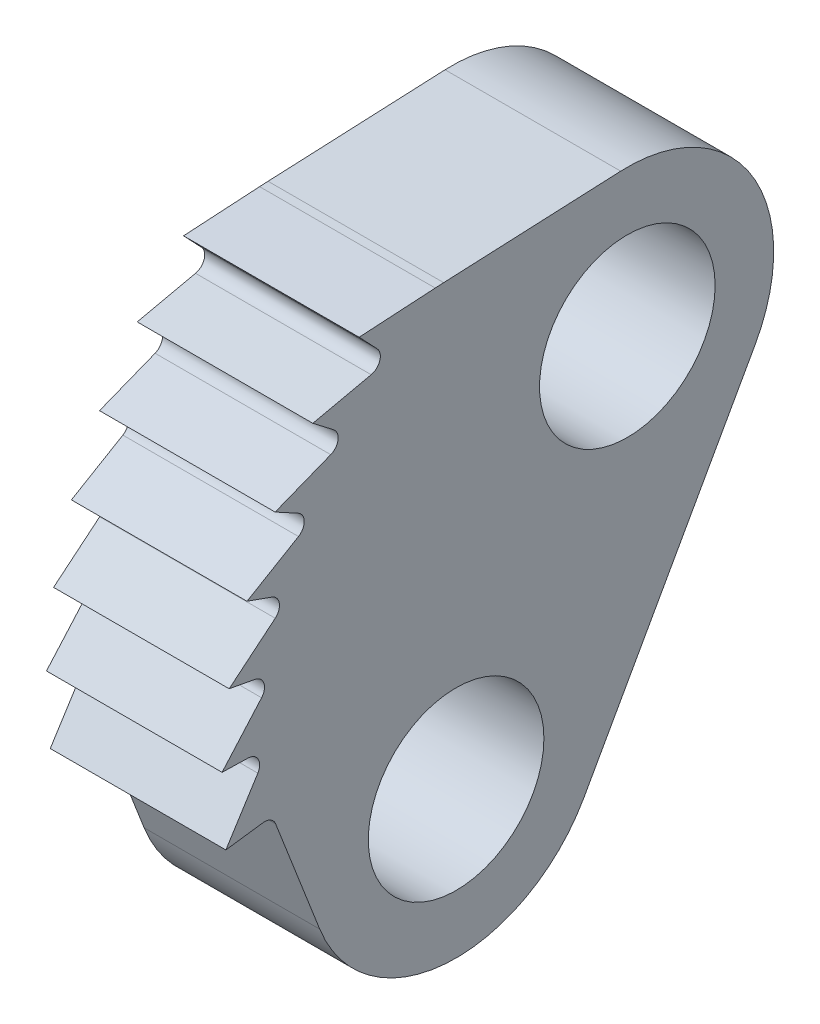
ISO-10303-21;
HEADER;
FILE_DESCRIPTION(('STEP AP214'),'2;1');
FILE_NAME('part.step','',(''),(''),'','','');
FILE_SCHEMA(('AUTOMOTIVE_DESIGN { 1 0 10303 214 1 1 1 1 }'));
ENDSEC;
DATA;
#1=APPLICATION_CONTEXT('core data for automotive mechanical design processes');
#2=APPLICATION_PROTOCOL_DEFINITION('international standard','automotive_design',2000,#1);
#3=PRODUCT_CONTEXT('',#1,'mechanical');
#4=PRODUCT('Part','Part','',(#3));
#5=PRODUCT_RELATED_PRODUCT_CATEGORY('part','',(#4));
#6=PRODUCT_DEFINITION_FORMATION('','',#4);
#7=PRODUCT_DEFINITION_CONTEXT('part definition',#1,'design');
#8=PRODUCT_DEFINITION('design','',#6,#7);
#9=PRODUCT_DEFINITION_SHAPE('','',#8);
#10=(LENGTH_UNIT() NAMED_UNIT(*) SI_UNIT(.MILLI.,.METRE.));
#11=(NAMED_UNIT(*) PLANE_ANGLE_UNIT() SI_UNIT($,.RADIAN.));
#12=(NAMED_UNIT(*) SI_UNIT($,.STERADIAN.) SOLID_ANGLE_UNIT());
#13=UNCERTAINTY_MEASURE_WITH_UNIT(LENGTH_MEASURE(1.E-05),#10,'distance_accuracy_value','');
#14=(GEOMETRIC_REPRESENTATION_CONTEXT(3) GLOBAL_UNCERTAINTY_ASSIGNED_CONTEXT((#13)) GLOBAL_UNIT_ASSIGNED_CONTEXT((#10,
#11,#12)) REPRESENTATION_CONTEXT('',''));
#15=CARTESIAN_POINT('',(0.,0.,0.));
#16=DIRECTION('',(0.,0.,1.));
#17=DIRECTION('',(1.,0.,0.));
#18=AXIS2_PLACEMENT_3D('',#15,#16,#17);
#19=CARTESIAN_POINT('',(3.,-43.5888383986154,-39.9249991557742));
#20=DIRECTION('',(1.,0.,0.));
#21=DIRECTION('',(0.,0.,-1.));
#22=AXIS2_PLACEMENT_3D('',#19,#20,#21);
#23=PLANE('',#22);
#24=CARTESIAN_POINT('',(3.,-43.5888383986154,-39.9249991557742));
#25=DIRECTION('',(1.,0.,0.));
#26=DIRECTION('',(0.,0.,-1.));
#27=AXIS2_PLACEMENT_3D('',#24,#25,#26);
#28=CIRCLE('',#27,1.5);
#29=CARTESIAN_POINT('',(3.,-43.5888383986154,-41.4249991557742));
#30=VERTEX_POINT('',#29);
#31=EDGE_CURVE('E268',#30,#30,#28,.T.);
#32=ORIENTED_EDGE('',*,*,#31,.F.);
#33=EDGE_LOOP('',(#32));
#34=FACE_BOUND('',#33,.T.);
#35=DIRECTION('',(0.,-0.0454217464710192,0.99896789985841));
#36=VECTOR('',#35,1.);
#37=CARTESIAN_POINT('',(3.,-41.2321933597373,-36.7153635488898));
#38=LINE('',#37,#36);
#39=CARTESIAN_POINT('',(3.,-41.0914186489693,-39.8114447895967));
#40=VERTEX_POINT('',#39);
#41=CARTESIAN_POINT('',(3.,-41.228909742996,-36.7875806689883));
#42=VERTEX_POINT('',#41);
#43=EDGE_CURVE('E245',#40,#42,#38,.T.);
#44=ORIENTED_EDGE('',*,*,#43,.T.);
#45=CARTESIAN_POINT('',(3.,-51.2185887415801,-37.2417981336985));
#46=DIRECTION('',(1.,0.,0.));
#47=DIRECTION('',(0.,0.,-1.));
#48=AXIS2_PLACEMENT_3D('',#45,#46,#47);
#49=CIRCLE('',#48,10.);
#50=CARTESIAN_POINT('',(3.,-41.236520718866,-36.6432014498543));
#51=VERTEX_POINT('',#50);
#52=EDGE_CURVE('E343',#42,#51,#49,.T.);
#53=ORIENTED_EDGE('',*,*,#52,.T.);
#54=DIRECTION('',(0.,-0.0598596683844226,0.998206802271407));
#55=VECTOR('',#54,1.);
#56=CARTESIAN_POINT('',(3.,-41.3144407469727,-35.3438240194671));
#57=LINE('',#56,#55);
#58=CARTESIAN_POINT('',(3.,-41.3144407469727,-35.3438240194671));
#59=VERTEX_POINT('',#58);
#60=EDGE_CURVE('E247',#51,#59,#57,.T.);
#61=ORIENTED_EDGE('',*,*,#60,.T.);
#62=DIRECTION('',(0.,-0.726193720806112,-0.687490130737726));
#63=VECTOR('',#62,1.);
#64=CARTESIAN_POINT('',(3.,-41.8953957236175,-35.8938161240573));
#65=LINE('',#64,#63);
#66=CARTESIAN_POINT('',(3.,-41.6388877953287,-35.6509791728389));
#67=VERTEX_POINT('',#66);
#68=EDGE_CURVE('E249',#59,#67,#65,.T.);
#69=ORIENTED_EDGE('',*,*,#68,.T.);
#70=CARTESIAN_POINT('',(3.,-41.7763858214763,-35.5057404286776));
#71=DIRECTION('',(1.,0.,0.));
#72=DIRECTION('',(0.,0.,-1.));
#73=AXIS2_PLACEMENT_3D('',#70,#71,#72);
#74=CIRCLE('',#73,0.2);
#75=CARTESIAN_POINT('',(3.,-41.9716675303531,-35.5489267017066));
#76=VERTEX_POINT('',#75);
#77=EDGE_CURVE('E379',#67,#76,#74,.F.);
#78=ORIENTED_EDGE('',*,*,#77,.T.);
#79=DIRECTION('',(0.,-0.215931365144987,0.976408544384277));
#80=VECTOR('',#79,1.);
#81=CARTESIAN_POINT('',(3.,-42.1920861511569,-34.5522274748498));
#82=LINE('',#81,#80);
#83=CARTESIAN_POINT('',(3.,-42.1920861511569,-34.5522274748498));
#84=VERTEX_POINT('',#83);
#85=EDGE_CURVE('E252',#76,#84,#82,.T.);
#86=ORIENTED_EDGE('',*,*,#85,.T.);
#87=DIRECTION('',(0.,-0.609174333581545,-0.793036336686713));
#88=VECTOR('',#87,1.);
#89=CARTESIAN_POINT('',(3.,-42.6794256180221,-35.1866565441991));
#90=LINE('',#89,#88);
#91=CARTESIAN_POINT('',(3.,-42.4642515648779,-34.9065383030837));
#92=VERTEX_POINT('',#91);
#93=EDGE_CURVE('E254',#84,#92,#90,.T.);
#94=ORIENTED_EDGE('',*,*,#93,.T.);
#95=CARTESIAN_POINT('',(3.,-42.6228588322152,-34.7847034363674));
#96=DIRECTION('',(1.,0.,0.));
#97=DIRECTION('',(0.,0.,-1.));
#98=AXIS2_PLACEMENT_3D('',#95,#96,#97);
#99=CIRCLE('',#98,0.2);
#100=CARTESIAN_POINT('',(3.,-42.8089313536639,-34.8580315807712));
#101=VERTEX_POINT('',#100);
#102=EDGE_CURVE('E383',#92,#101,#99,.F.);
#103=ORIENTED_EDGE('',*,*,#102,.T.);
#104=DIRECTION('',(0.,-0.36664072201932,0.930362607243623));
#105=VECTOR('',#104,1.);
#106=CARTESIAN_POINT('',(3.,-43.1831912126877,-33.9083351686808));
#107=LINE('',#106,#105);
#108=CARTESIAN_POINT('',(3.,-43.1831912126877,-33.9083351686808));
#109=VERTEX_POINT('',#108);
#110=EDGE_CURVE('E257',#101,#109,#107,.T.);
#111=ORIENTED_EDGE('',*,*,#110,.T.);
#112=DIRECTION('',(0.,-0.4770269920441,-0.878888644175904));
#113=VECTOR('',#112,1.);
#114=CARTESIAN_POINT('',(3.,-43.564812806323,-34.6114460840214));
#115=LINE('',#114,#113);
#116=CARTESIAN_POINT('',(3.,-43.3963161614728,-34.3010028801558));
#117=VERTEX_POINT('',#116);
#118=EDGE_CURVE('E259',#109,#117,#115,.T.);
#119=ORIENTED_EDGE('',*,*,#118,.T.);
#120=CARTESIAN_POINT('',(3.,-43.5720938903081,-34.205597481747));
#121=DIRECTION('',(1.,0.,0.));
#122=DIRECTION('',(0.,0.,-1.));
#123=AXIS2_PLACEMENT_3D('',#120,#121,#122);
#124=CIRCLE('',#123,0.2);
#125=CARTESIAN_POINT('',(3.,-43.7443363851892,-34.307246500223));
#126=VERTEX_POINT('',#125);
#127=EDGE_CURVE('E387',#117,#126,#124,.F.);
#128=ORIENTED_EDGE('',*,*,#127,.T.);
#129=DIRECTION('',(0.,-0.508245092379624,0.861212474405723));
#130=VECTOR('',#129,1.);
#131=CARTESIAN_POINT('',(3.,-44.2631432857863,-33.4281372253846));
#132=LINE('',#131,#130);
#133=CARTESIAN_POINT('',(3.,-44.2631432857863,-33.4281372253846));
#134=VERTEX_POINT('',#133);
#135=EDGE_CURVE('E262',#126,#134,#132,.T.);
#136=ORIENTED_EDGE('',*,*,#135,.T.);
#137=DIRECTION('',(0.,-0.333033382297625,-0.942915036615391));
#138=VECTOR('',#137,1.);
#139=CARTESIAN_POINT('',(3.,-44.5295699916245,-34.1824692546769));
#140=LINE('',#139,#138);
#141=CARTESIAN_POINT('',(3.,-44.4119351229983,-33.8494104913402));
#142=VERTEX_POINT('',#141);
#143=EDGE_CURVE('E209',#134,#142,#140,.T.);
#144=ORIENTED_EDGE('',*,*,#143,.T.);
#145=CARTESIAN_POINT('',(3.,-44.6005181303213,-33.7828038148807));
#146=DIRECTION('',(1.,0.,0.));
#147=DIRECTION('',(0.,0.,-1.));
#148=AXIS2_PLACEMENT_3D('',#145,#146,#147);
#149=CIRCLE('',#148,0.2);
#150=CARTESIAN_POINT('',(3.,-44.7546532079938,-33.910249402607));
#151=VERTEX_POINT('',#150);
#152=EDGE_CURVE('E205',#142,#151,#149,.F.);
#153=ORIENTED_EDGE('',*,*,#152,.T.);
#154=DIRECTION('',(0.,-0.637227938631925,0.770675388361992));
#155=VECTOR('',#154,1.);
#156=CARTESIAN_POINT('',(3.,-45.4051233389844,-33.1235586591105));
#157=LINE('',#156,#155);
#158=CARTESIAN_POINT('',(3.,-45.4051233389844,-33.1235586591105));
#159=VERTEX_POINT('',#158);
#160=EDGE_CURVE('E196',#151,#159,#157,.T.);
#161=ORIENTED_EDGE('',*,*,#160,.T.);
#162=DIRECTION('',(0.,-0.180769375204551,-0.983525512118601));
#163=VECTOR('',#162,1.);
#164=CARTESIAN_POINT('',(3.,-45.549738839148,-33.9103790688054));
#165=LINE('',#164,#163);
#166=CARTESIAN_POINT('',(3.,-45.4858870367938,-33.5629757736451));
#167=VERTEX_POINT('',#166);
#168=EDGE_CURVE('E201',#159,#167,#165,.T.);
#169=ORIENTED_EDGE('',*,*,#168,.T.);
#170=CARTESIAN_POINT('',(3.,-45.6825921392175,-33.5268218986042));
#171=DIRECTION('',(1.,0.,0.));
#172=DIRECTION('',(0.,0.,-1.));
#173=AXIS2_PLACEMENT_3D('',#170,#171,#172);
#174=CIRCLE('',#173,0.2);
#175=CARTESIAN_POINT('',(3.,-45.8147920802838,-33.6768991306618));
#176=VERTEX_POINT('',#175);
#177=EDGE_CURVE('E398',#167,#176,#174,.F.);
#178=ORIENTED_EDGE('',*,*,#177,.T.);
#179=DIRECTION('',(0.,-0.750386160288116,0.660999705331294));
#180=VECTOR('',#179,1.);
#181=CARTESIAN_POINT('',(3.,-46.5807719665771,-33.0021632334337));
#182=LINE('',#181,#180);
#183=CARTESIAN_POINT('',(3.,-46.5807719665771,-33.0021632334337));
#184=VERTEX_POINT('',#183);
#185=EDGE_CURVE('E225',#176,#184,#182,.T.);
#186=ORIENTED_EDGE('',*,*,#185,.T.);
#187=DIRECTION('',(0.,-0.0240162248588486,-0.999711568875508));
#188=VECTOR('',#187,1.);
#189=CARTESIAN_POINT('',(3.,-46.5999849464642,-33.8019324885341));
#190=LINE('',#189,#188);
#191=CARTESIAN_POINT('',(3.,-46.5915018765789,-33.4488119146823));
#192=VERTEX_POINT('',#191);
#193=EDGE_CURVE('E227',#184,#192,#190,.T.);
#194=ORIENTED_EDGE('',*,*,#193,.T.);
#195=CARTESIAN_POINT('',(3.,-46.791444190354,-33.4440086697105));
#196=DIRECTION('',(1.,0.,0.));
#197=DIRECTION('',(0.,0.,-1.));
#198=AXIS2_PLACEMENT_3D('',#195,#196,#197);
#199=CIRCLE('',#198,0.2);
#200=CARTESIAN_POINT('',(3.,-46.8984260024778,-33.6129905973676));
#201=VERTEX_POINT('',#200);
#202=EDGE_CURVE('E11',#192,#201,#199,.F.);
#203=ORIENTED_EDGE('',*,*,#202,.T.);
#204=DIRECTION('',(0.,-0.8449096382854,0.534909060619124));
#205=VECTOR('',#204,1.);
#206=CARTESIAN_POINT('',(3.,-47.7608936530185,-33.0669656263407));
#207=LINE('',#206,#205);
#208=CARTESIAN_POINT('',(3.,-47.7608936530185,-33.0669656263407));
#209=VERTEX_POINT('',#208);
#210=EDGE_CURVE('E232',#201,#209,#207,.T.);
#211=ORIENTED_EDGE('',*,*,#210,.T.);
#212=DIRECTION('',(0.,0.133333333333322,-0.991071249821235));
#213=VECTOR('',#212,1.);
#214=CARTESIAN_POINT('',(3.,-47.6542269863519,-33.8598226261978));
#215=LINE('',#214,#213);
#216=CARTESIAN_POINT('',(3.,-47.6752026310834,-33.7039099378987));
#217=VERTEX_POINT('',#216);
#218=EDGE_CURVE('E234',#209,#217,#215,.T.);
#219=ORIENTED_EDGE('',*,*,#218,.T.);
#220=CARTESIAN_POINT('',(3.,-47.8734168810476,-33.7305766045654));
#221=DIRECTION('',(1.,0.,0.));
#222=DIRECTION('',(0.,0.,-1.));
#223=AXIS2_PLACEMENT_3D('',#220,#221,#222);
#224=CIRCLE('',#223,0.2);
#225=CARTESIAN_POINT('',(3.,-47.8008121084282,-33.9169325730581));
#226=VERTEX_POINT('',#225);
#227=EDGE_CURVE('E391',#217,#226,#224,.F.);
#228=ORIENTED_EDGE('',*,*,#227,.T.);
#229=DIRECTION('',(0.,-0.931779842463879,-0.363023863097166));
#230=VECTOR('',#229,1.);
#231=CARTESIAN_POINT('',(3.,-47.6542269863519,-33.8598226261978));
#232=LINE('',#231,#230);
#233=CARTESIAN_POINT('',(3.,-49.7351364482538,-34.6705503938403));
#234=VERTEX_POINT('',#233);
#235=EDGE_CURVE('E237',#226,#234,#232,.T.);
#236=ORIENTED_EDGE('',*,*,#235,.T.);
#237=CARTESIAN_POINT('',(3.,-48.8275767905109,-37.));
#238=DIRECTION('',(1.,0.,0.));
#239=DIRECTION('',(0.,0.,-1.));
#240=AXIS2_PLACEMENT_3D('',#237,#238,#239);
#241=CIRCLE('',#240,2.5);
#242=CARTESIAN_POINT('',(3.,-50.0463264387501,-39.1828076632898));
#243=VERTEX_POINT('',#242);
#244=EDGE_CURVE('E239',#234,#243,#241,.T.);
#245=ORIENTED_EDGE('',*,*,#244,.T.);
#246=DIRECTION('',(0.,0.873123065315921,-0.487499859295703));
#247=VECTOR('',#246,1.);
#248=CARTESIAN_POINT('',(3.,-50.0463264387501,-39.1828076632898));
#249=LINE('',#248,#247);
#250=CARTESIAN_POINT('',(3.,-44.8075880468546,-42.1078068190641));
#251=VERTEX_POINT('',#250);
#252=EDGE_CURVE('E241',#243,#251,#249,.T.);
#253=ORIENTED_EDGE('',*,*,#252,.T.);
#254=CARTESIAN_POINT('',(3.,-43.5888383986154,-39.9249991557742));
#255=DIRECTION('',(1.,0.,0.));
#256=DIRECTION('',(0.,0.,-1.));
#257=AXIS2_PLACEMENT_3D('',#254,#255,#256);
#258=CIRCLE('',#257,2.5);
#259=EDGE_CURVE('E243',#251,#40,#258,.T.);
#260=ORIENTED_EDGE('',*,*,#259,.T.);
#261=EDGE_LOOP('',(#44,#53,#61,#69,#78,#86,#94,#103,#111,#119,#128,#136,#144,#153,#161,#169,
#178,#186,#194,#203,#211,#219,#228,#236,#245,#253,#260));
#262=FACE_BOUND('',#261,.T.);
#263=CARTESIAN_POINT('',(3.,-48.8275767905109,-37.));
#264=DIRECTION('',(1.,0.,0.));
#265=DIRECTION('',(0.,0.,-1.));
#266=AXIS2_PLACEMENT_3D('',#263,#264,#265);
#267=CIRCLE('',#266,1.5);
#268=CARTESIAN_POINT('',(3.,-48.8275767905109,-38.5));
#269=VERTEX_POINT('',#268);
#270=EDGE_CURVE('E511',#269,#269,#267,.T.);
#271=ORIENTED_EDGE('',*,*,#270,.F.);
#272=EDGE_LOOP('',(#271));
#273=FACE_BOUND('',#272,.T.);
#274=ADVANCED_FACE('F17',(#34,#262,#273),#23,.T.);
#275=CARTESIAN_POINT('',(0.,-43.5888383986154,-39.9249991557742));
#276=DIRECTION('',(1.,0.,0.));
#277=DIRECTION('',(0.,0.,-1.));
#278=AXIS2_PLACEMENT_3D('',#275,#276,#277);
#279=PLANE('',#278);
#280=DIRECTION('',(0.,-0.0598596683844226,0.998206802271407));
#281=VECTOR('',#280,1.);
#282=CARTESIAN_POINT('',(0.,-41.3144407469727,-35.3438240194671));
#283=LINE('',#282,#281);
#284=CARTESIAN_POINT('',(0.,-41.236520718866,-36.6432014498543));
#285=VERTEX_POINT('',#284);
#286=CARTESIAN_POINT('',(0.,-41.3144407469727,-35.3438240194671));
#287=VERTEX_POINT('',#286);
#288=EDGE_CURVE('E292',#285,#287,#283,.T.);
#289=ORIENTED_EDGE('',*,*,#288,.F.);
#290=CARTESIAN_POINT('',(0.,-51.2185887415801,-37.2417981336985));
#291=DIRECTION('',(1.,0.,0.));
#292=DIRECTION('',(0.,0.,-1.));
#293=AXIS2_PLACEMENT_3D('',#290,#291,#292);
#294=CIRCLE('',#293,10.);
#295=CARTESIAN_POINT('',(0.,-41.228909742996,-36.7875806689883));
#296=VERTEX_POINT('',#295);
#297=EDGE_CURVE('E339',#285,#296,#294,.F.);
#298=ORIENTED_EDGE('',*,*,#297,.T.);
#299=DIRECTION('',(0.,-0.0454217464710192,0.99896789985841));
#300=VECTOR('',#299,1.);
#301=CARTESIAN_POINT('',(0.,-41.2321933597373,-36.7153635488898));
#302=LINE('',#301,#300);
#303=CARTESIAN_POINT('',(0.,-41.0914186489693,-39.8114447895967));
#304=VERTEX_POINT('',#303);
#305=EDGE_CURVE('E289',#304,#296,#302,.T.);
#306=ORIENTED_EDGE('',*,*,#305,.F.);
#307=CARTESIAN_POINT('',(0.,-43.5888383986154,-39.9249991557742));
#308=DIRECTION('',(1.,0.,0.));
#309=DIRECTION('',(0.,0.,-1.));
#310=AXIS2_PLACEMENT_3D('',#307,#308,#309);
#311=CIRCLE('',#310,2.5);
#312=CARTESIAN_POINT('',(0.,-44.8075880468546,-42.1078068190641));
#313=VERTEX_POINT('',#312);
#314=EDGE_CURVE('E287',#313,#304,#311,.T.);
#315=ORIENTED_EDGE('',*,*,#314,.F.);
#316=DIRECTION('',(0.,0.873123065315921,-0.487499859295703));
#317=VECTOR('',#316,1.);
#318=CARTESIAN_POINT('',(0.,-50.0463264387501,-39.1828076632898));
#319=LINE('',#318,#317);
#320=CARTESIAN_POINT('',(0.,-50.0463264387501,-39.1828076632898));
#321=VERTEX_POINT('',#320);
#322=EDGE_CURVE('E285',#321,#313,#319,.T.);
#323=ORIENTED_EDGE('',*,*,#322,.F.);
#324=CARTESIAN_POINT('',(0.,-48.8275767905109,-37.));
#325=DIRECTION('',(1.,0.,0.));
#326=DIRECTION('',(0.,0.,-1.));
#327=AXIS2_PLACEMENT_3D('',#324,#325,#326);
#328=CIRCLE('',#327,2.5);
#329=CARTESIAN_POINT('',(0.,-49.7351364482538,-34.6705503938403));
#330=VERTEX_POINT('',#329);
#331=EDGE_CURVE('E283',#330,#321,#328,.T.);
#332=ORIENTED_EDGE('',*,*,#331,.F.);
#333=DIRECTION('',(0.,-0.931779842463879,-0.363023863097166));
#334=VECTOR('',#333,1.);
#335=CARTESIAN_POINT('',(0.,-47.6542269863519,-33.8598226261978));
#336=LINE('',#335,#334);
#337=CARTESIAN_POINT('',(0.,-47.8008121084282,-33.9169325730581));
#338=VERTEX_POINT('',#337);
#339=EDGE_CURVE('E281',#338,#330,#336,.T.);
#340=ORIENTED_EDGE('',*,*,#339,.F.);
#341=CARTESIAN_POINT('',(0.,-47.8734168810476,-33.7305766045654));
#342=DIRECTION('',(1.,0.,0.));
#343=DIRECTION('',(0.,0.,-1.));
#344=AXIS2_PLACEMENT_3D('',#341,#342,#343);
#345=CIRCLE('',#344,0.2);
#346=CARTESIAN_POINT('',(0.,-47.6752026310834,-33.7039099378987));
#347=VERTEX_POINT('',#346);
#348=EDGE_CURVE('E389',#338,#347,#345,.T.);
#349=ORIENTED_EDGE('',*,*,#348,.T.);
#350=DIRECTION('',(0.,0.133333333333322,-0.991071249821235));
#351=VECTOR('',#350,1.);
#352=CARTESIAN_POINT('',(0.,-47.6542269863519,-33.8598226261978));
#353=LINE('',#352,#351);
#354=CARTESIAN_POINT('',(0.,-47.7608936530185,-33.0669656263407));
#355=VERTEX_POINT('',#354);
#356=EDGE_CURVE('E278',#355,#347,#353,.T.);
#357=ORIENTED_EDGE('',*,*,#356,.F.);
#358=DIRECTION('',(0.,-0.8449096382854,0.534909060619124));
#359=VECTOR('',#358,1.);
#360=CARTESIAN_POINT('',(0.,-47.7608936530185,-33.0669656263407));
#361=LINE('',#360,#359);
#362=CARTESIAN_POINT('',(0.,-46.8984260024778,-33.6129905973676));
#363=VERTEX_POINT('',#362);
#364=EDGE_CURVE('E276',#363,#355,#361,.T.);
#365=ORIENTED_EDGE('',*,*,#364,.F.);
#366=CARTESIAN_POINT('',(0.,-46.791444190354,-33.4440086697105));
#367=DIRECTION('',(1.,0.,0.));
#368=DIRECTION('',(0.,0.,-1.));
#369=AXIS2_PLACEMENT_3D('',#366,#367,#368);
#370=CIRCLE('',#369,0.2);
#371=CARTESIAN_POINT('',(0.,-46.5915018765789,-33.4488119146823));
#372=VERTEX_POINT('',#371);
#373=EDGE_CURVE('E25',#363,#372,#370,.T.);
#374=ORIENTED_EDGE('',*,*,#373,.T.);
#375=DIRECTION('',(0.,-0.0240162248588486,-0.999711568875508));
#376=VECTOR('',#375,1.);
#377=CARTESIAN_POINT('',(0.,-46.5999849464642,-33.8019324885341));
#378=LINE('',#377,#376);
#379=CARTESIAN_POINT('',(0.,-46.5807719665771,-33.0021632334337));
#380=VERTEX_POINT('',#379);
#381=EDGE_CURVE('E274',#380,#372,#378,.T.);
#382=ORIENTED_EDGE('',*,*,#381,.F.);
#383=DIRECTION('',(0.,-0.750386160288116,0.660999705331294));
#384=VECTOR('',#383,1.);
#385=CARTESIAN_POINT('',(0.,-46.5807719665771,-33.0021632334337));
#386=LINE('',#385,#384);
#387=CARTESIAN_POINT('',(0.,-45.8147920802838,-33.6768991306618));
#388=VERTEX_POINT('',#387);
#389=EDGE_CURVE('E272',#388,#380,#386,.T.);
#390=ORIENTED_EDGE('',*,*,#389,.F.);
#391=CARTESIAN_POINT('',(0.,-45.6825921392175,-33.5268218986042));
#392=DIRECTION('',(1.,0.,0.));
#393=DIRECTION('',(0.,0.,-1.));
#394=AXIS2_PLACEMENT_3D('',#391,#392,#393);
#395=CIRCLE('',#394,0.2);
#396=CARTESIAN_POINT('',(0.,-45.4858870367938,-33.5629757736451));
#397=VERTEX_POINT('',#396);
#398=EDGE_CURVE('E396',#388,#397,#395,.T.);
#399=ORIENTED_EDGE('',*,*,#398,.T.);
#400=DIRECTION('',(0.,-0.180769375204551,-0.983525512118601));
#401=VECTOR('',#400,1.);
#402=CARTESIAN_POINT('',(0.,-45.549738839148,-33.9103790688054));
#403=LINE('',#402,#401);
#404=CARTESIAN_POINT('',(0.,-45.4051233389844,-33.1235586591105));
#405=VERTEX_POINT('',#404);
#406=EDGE_CURVE('E270',#405,#397,#403,.T.);
#407=ORIENTED_EDGE('',*,*,#406,.F.);
#408=DIRECTION('',(0.,-0.637227938631925,0.770675388361992));
#409=VECTOR('',#408,1.);
#410=CARTESIAN_POINT('',(0.,-45.4051233389844,-33.1235586591105));
#411=LINE('',#410,#409);
#412=CARTESIAN_POINT('',(0.,-44.7546532079938,-33.910249402607));
#413=VERTEX_POINT('',#412);
#414=EDGE_CURVE('E215',#413,#405,#411,.T.);
#415=ORIENTED_EDGE('',*,*,#414,.F.);
#416=CARTESIAN_POINT('',(0.,-44.6005181303213,-33.7828038148807));
#417=DIRECTION('',(1.,0.,0.));
#418=DIRECTION('',(0.,0.,-1.));
#419=AXIS2_PLACEMENT_3D('',#416,#417,#418);
#420=CIRCLE('',#419,0.2);
#421=CARTESIAN_POINT('',(0.,-44.4119351229983,-33.8494104913402));
#422=VERTEX_POINT('',#421);
#423=EDGE_CURVE('E393',#413,#422,#420,.T.);
#424=ORIENTED_EDGE('',*,*,#423,.T.);
#425=DIRECTION('',(0.,-0.333033382297625,-0.942915036615391));
#426=VECTOR('',#425,1.);
#427=CARTESIAN_POINT('',(0.,-44.5295699916245,-34.1824692546769));
#428=LINE('',#427,#426);
#429=CARTESIAN_POINT('',(0.,-44.2631432857863,-33.4281372253846));
#430=VERTEX_POINT('',#429);
#431=EDGE_CURVE('E265',#430,#422,#428,.T.);
#432=ORIENTED_EDGE('',*,*,#431,.F.);
#433=DIRECTION('',(0.,-0.508245092379624,0.861212474405723));
#434=VECTOR('',#433,1.);
#435=CARTESIAN_POINT('',(0.,-44.2631432857863,-33.4281372253846));
#436=LINE('',#435,#434);
#437=CARTESIAN_POINT('',(0.,-43.7443363851892,-34.307246500223));
#438=VERTEX_POINT('',#437);
#439=EDGE_CURVE('E307',#438,#430,#436,.T.);
#440=ORIENTED_EDGE('',*,*,#439,.F.);
#441=CARTESIAN_POINT('',(0.,-43.5720938903081,-34.205597481747));
#442=DIRECTION('',(1.,0.,0.));
#443=DIRECTION('',(0.,0.,-1.));
#444=AXIS2_PLACEMENT_3D('',#441,#442,#443);
#445=CIRCLE('',#444,0.2);
#446=CARTESIAN_POINT('',(0.,-43.3963161614728,-34.3010028801558));
#447=VERTEX_POINT('',#446);
#448=EDGE_CURVE('E385',#438,#447,#445,.T.);
#449=ORIENTED_EDGE('',*,*,#448,.T.);
#450=DIRECTION('',(0.,-0.4770269920441,-0.878888644175904));
#451=VECTOR('',#450,1.);
#452=CARTESIAN_POINT('',(0.,-43.564812806323,-34.6114460840214));
#453=LINE('',#452,#451);
#454=CARTESIAN_POINT('',(0.,-43.1831912126877,-33.9083351686808));
#455=VERTEX_POINT('',#454);
#456=EDGE_CURVE('E304',#455,#447,#453,.T.);
#457=ORIENTED_EDGE('',*,*,#456,.F.);
#458=DIRECTION('',(0.,-0.36664072201932,0.930362607243623));
#459=VECTOR('',#458,1.);
#460=CARTESIAN_POINT('',(0.,-43.1831912126877,-33.9083351686808));
#461=LINE('',#460,#459);
#462=CARTESIAN_POINT('',(0.,-42.8089313536639,-34.8580315807712));
#463=VERTEX_POINT('',#462);
#464=EDGE_CURVE('E302',#463,#455,#461,.T.);
#465=ORIENTED_EDGE('',*,*,#464,.F.);
#466=CARTESIAN_POINT('',(0.,-42.6228588322152,-34.7847034363674));
#467=DIRECTION('',(1.,0.,0.));
#468=DIRECTION('',(0.,0.,-1.));
#469=AXIS2_PLACEMENT_3D('',#466,#467,#468);
#470=CIRCLE('',#469,0.2);
#471=CARTESIAN_POINT('',(0.,-42.4642515648779,-34.9065383030837));
#472=VERTEX_POINT('',#471);
#473=EDGE_CURVE('E381',#463,#472,#470,.T.);
#474=ORIENTED_EDGE('',*,*,#473,.T.);
#475=DIRECTION('',(0.,-0.609174333581545,-0.793036336686713));
#476=VECTOR('',#475,1.);
#477=CARTESIAN_POINT('',(0.,-42.6794256180221,-35.1866565441991));
#478=LINE('',#477,#476);
#479=CARTESIAN_POINT('',(0.,-42.1920861511569,-34.5522274748498));
#480=VERTEX_POINT('',#479);
#481=EDGE_CURVE('E299',#480,#472,#478,.T.);
#482=ORIENTED_EDGE('',*,*,#481,.F.);
#483=DIRECTION('',(0.,-0.215931365144987,0.976408544384277));
#484=VECTOR('',#483,1.);
#485=CARTESIAN_POINT('',(0.,-42.1920861511569,-34.5522274748498));
#486=LINE('',#485,#484);
#487=CARTESIAN_POINT('',(0.,-41.9716675303531,-35.5489267017066));
#488=VERTEX_POINT('',#487);
#489=EDGE_CURVE('E297',#488,#480,#486,.T.);
#490=ORIENTED_EDGE('',*,*,#489,.F.);
#491=CARTESIAN_POINT('',(0.,-41.7763858214763,-35.5057404286776));
#492=DIRECTION('',(1.,0.,0.));
#493=DIRECTION('',(0.,0.,-1.));
#494=AXIS2_PLACEMENT_3D('',#491,#492,#493);
#495=CIRCLE('',#494,0.2);
#496=CARTESIAN_POINT('',(0.,-41.6388877953287,-35.6509791728389));
#497=VERTEX_POINT('',#496);
#498=EDGE_CURVE('E377',#488,#497,#495,.T.);
#499=ORIENTED_EDGE('',*,*,#498,.T.);
#500=DIRECTION('',(0.,-0.726193720806112,-0.687490130737726));
#501=VECTOR('',#500,1.);
#502=CARTESIAN_POINT('',(0.,-41.8953957236175,-35.8938161240573));
#503=LINE('',#502,#501);
#504=EDGE_CURVE('E294',#287,#497,#503,.T.);
#505=ORIENTED_EDGE('',*,*,#504,.F.);
#506=EDGE_LOOP('',(#289,#298,#306,#315,#323,#332,#340,#349,#357,#365,#374,#382,#390,#399,#407,
#415,#424,#432,#440,#449,#457,#465,#474,#482,#490,#499,#505));
#507=FACE_BOUND('',#506,.T.);
#508=CARTESIAN_POINT('',(0.,-43.5888383986154,-39.9249991557742));
#509=DIRECTION('',(1.,0.,0.));
#510=DIRECTION('',(0.,0.,-1.));
#511=AXIS2_PLACEMENT_3D('',#508,#509,#510);
#512=CIRCLE('',#511,1.5);
#513=CARTESIAN_POINT('',(0.,-43.5888383986154,-41.4249991557742));
#514=VERTEX_POINT('',#513);
#515=EDGE_CURVE('E508',#514,#514,#512,.T.);
#516=ORIENTED_EDGE('',*,*,#515,.T.);
#517=EDGE_LOOP('',(#516));
#518=FACE_BOUND('',#517,.T.);
#519=CARTESIAN_POINT('',(0.,-48.8275767905109,-37.));
#520=DIRECTION('',(1.,0.,0.));
#521=DIRECTION('',(0.,0.,-1.));
#522=AXIS2_PLACEMENT_3D('',#519,#520,#521);
#523=CIRCLE('',#522,1.5);
#524=CARTESIAN_POINT('',(0.,-48.8275767905109,-38.5));
#525=VERTEX_POINT('',#524);
#526=EDGE_CURVE('E514',#525,#525,#523,.T.);
#527=ORIENTED_EDGE('',*,*,#526,.T.);
#528=EDGE_LOOP('',(#527));
#529=FACE_BOUND('',#528,.T.);
#530=ADVANCED_FACE('F408',(#507,#518,#529),#279,.F.);
#531=CARTESIAN_POINT('',(3.,-44.5295699916245,-34.1824692546769));
#532=DIRECTION('',(0.,0.942915036615391,-0.333033382297625));
#533=DIRECTION('',(0.,0.333033382297625,0.942915036615391));
#534=AXIS2_PLACEMENT_3D('',#531,#532,#533);
#535=PLANE('',#534);
#536=ORIENTED_EDGE('',*,*,#431,.T.);
#537=DIRECTION('',(-1.,0.,0.));
#538=VECTOR('',#537,1.);
#539=CARTESIAN_POINT('',(3.,-44.4119351229983,-33.8494104913402));
#540=LINE('',#539,#538);
#541=EDGE_CURVE('E367',#422,#142,#540,.F.);
#542=ORIENTED_EDGE('',*,*,#541,.T.);
#543=ORIENTED_EDGE('',*,*,#143,.F.);
#544=DIRECTION('',(-1.,0.,0.));
#545=VECTOR('',#544,1.);
#546=CARTESIAN_POINT('',(3.,-44.2631432857863,-33.4281372253846));
#547=LINE('',#546,#545);
#548=EDGE_CURVE('E264',#134,#430,#547,.T.);
#549=ORIENTED_EDGE('',*,*,#548,.T.);
#550=EDGE_LOOP('',(#536,#542,#543,#549));
#551=FACE_BOUND('',#550,.T.);
#552=ADVANCED_FACE('F505',(#551),#535,.F.);
#553=CARTESIAN_POINT('',(3.,-45.4051233389844,-33.1235586591105));
#554=DIRECTION('',(0.,-0.770675388361992,-0.637227938631926));
#555=DIRECTION('',(0.,0.637227938631926,-0.770675388361992));
#556=AXIS2_PLACEMENT_3D('',#553,#554,#555);
#557=PLANE('',#556);
#558=ORIENTED_EDGE('',*,*,#160,.F.);
#559=DIRECTION('',(-1.,0.,0.));
#560=VECTOR('',#559,1.);
#561=CARTESIAN_POINT('',(0.,-44.7546532079938,-33.910249402607));
#562=LINE('',#561,#560);
#563=EDGE_CURVE('E365',#151,#413,#562,.T.);
#564=ORIENTED_EDGE('',*,*,#563,.T.);
#565=ORIENTED_EDGE('',*,*,#414,.T.);
#566=DIRECTION('',(-1.,0.,0.));
#567=VECTOR('',#566,1.);
#568=CARTESIAN_POINT('',(3.,-45.4051233389844,-33.1235586591105));
#569=LINE('',#568,#567);
#570=EDGE_CURVE('E212',#159,#405,#569,.T.);
#571=ORIENTED_EDGE('',*,*,#570,.F.);
#572=EDGE_LOOP('',(#558,#564,#565,#571));
#573=FACE_BOUND('',#572,.T.);
#574=ADVANCED_FACE('F213',(#573),#557,.F.);
#575=CARTESIAN_POINT('',(3.,-45.549738839148,-33.9103790688054));
#576=DIRECTION('',(0.,0.983525512118601,-0.180769375204551));
#577=DIRECTION('',(0.,0.180769375204551,0.983525512118601));
#578=AXIS2_PLACEMENT_3D('',#575,#576,#577);
#579=PLANE('',#578);
#580=ORIENTED_EDGE('',*,*,#406,.T.);
#581=DIRECTION('',(-1.,0.,0.));
#582=VECTOR('',#581,1.);
#583=CARTESIAN_POINT('',(3.,-45.4858870367938,-33.5629757736451));
#584=LINE('',#583,#582);
#585=EDGE_CURVE('E224',#397,#167,#584,.F.);
#586=ORIENTED_EDGE('',*,*,#585,.T.);
#587=ORIENTED_EDGE('',*,*,#168,.F.);
#588=ORIENTED_EDGE('',*,*,#570,.T.);
#589=EDGE_LOOP('',(#580,#586,#587,#588));
#590=FACE_BOUND('',#589,.T.);
#591=ADVANCED_FACE('F222',(#590),#579,.F.);
#592=CARTESIAN_POINT('',(3.,-46.5807719665771,-33.0021632334337));
#593=DIRECTION('',(0.,-0.660999705331294,-0.750386160288116));
#594=DIRECTION('',(0.,0.750386160288116,-0.660999705331295));
#595=AXIS2_PLACEMENT_3D('',#592,#593,#594);
#596=PLANE('',#595);
#597=ORIENTED_EDGE('',*,*,#185,.F.);
#598=DIRECTION('',(-1.,0.,0.));
#599=VECTOR('',#598,1.);
#600=CARTESIAN_POINT('',(0.,-45.8147920802838,-33.6768991306618));
#601=LINE('',#600,#599);
#602=EDGE_CURVE('E369',#176,#388,#601,.T.);
#603=ORIENTED_EDGE('',*,*,#602,.T.);
#604=ORIENTED_EDGE('',*,*,#389,.T.);
#605=DIRECTION('',(-1.,0.,0.));
#606=VECTOR('',#605,1.);
#607=CARTESIAN_POINT('',(3.,-46.5807719665771,-33.0021632334337));
#608=LINE('',#607,#606);
#609=EDGE_CURVE('E220',#184,#380,#608,.T.);
#610=ORIENTED_EDGE('',*,*,#609,.F.);
#611=EDGE_LOOP('',(#597,#603,#604,#610));
#612=FACE_BOUND('',#611,.T.);
#613=ADVANCED_FACE('F404',(#612),#596,.F.);
#614=CARTESIAN_POINT('',(3.,-46.5999849464642,-33.8019324885341));
#615=DIRECTION('',(0.,0.999711568875508,-0.0240162248588486));
#616=DIRECTION('',(0.,0.0240162248588486,0.999711568875508));
#617=AXIS2_PLACEMENT_3D('',#614,#615,#616);
#618=PLANE('',#617);
#619=ORIENTED_EDGE('',*,*,#381,.T.);
#620=DIRECTION('',(-1.,0.,0.));
#621=VECTOR('',#620,1.);
#622=CARTESIAN_POINT('',(3.,-46.5915018765789,-33.4488119146823));
#623=LINE('',#622,#621);
#624=EDGE_CURVE('E32',#372,#192,#623,.F.);
#625=ORIENTED_EDGE('',*,*,#624,.T.);
#626=ORIENTED_EDGE('',*,*,#193,.F.);
#627=ORIENTED_EDGE('',*,*,#609,.T.);
#628=EDGE_LOOP('',(#619,#625,#626,#627));
#629=FACE_BOUND('',#628,.T.);
#630=ADVANCED_FACE('F410',(#629),#618,.F.);
#631=CARTESIAN_POINT('',(3.,-47.7608936530185,-33.0669656263407));
#632=DIRECTION('',(0.,-0.534909060619124,-0.8449096382854));
#633=DIRECTION('',(0.,0.8449096382854,-0.534909060619124));
#634=AXIS2_PLACEMENT_3D('',#631,#632,#633);
#635=PLANE('',#634);
#636=ORIENTED_EDGE('',*,*,#210,.F.);
#637=DIRECTION('',(-1.,0.,0.));
#638=VECTOR('',#637,1.);
#639=CARTESIAN_POINT('',(0.,-46.8984260024778,-33.6129905973676));
#640=LINE('',#639,#638);
#641=EDGE_CURVE('E373',#201,#363,#640,.T.);
#642=ORIENTED_EDGE('',*,*,#641,.T.);
#643=ORIENTED_EDGE('',*,*,#364,.T.);
#644=DIRECTION('',(-1.,0.,0.));
#645=VECTOR('',#644,1.);
#646=CARTESIAN_POINT('',(3.,-47.7608936530185,-33.0669656263407));
#647=LINE('',#646,#645);
#648=EDGE_CURVE('E332',#209,#355,#647,.T.);
#649=ORIENTED_EDGE('',*,*,#648,.F.);
#650=EDGE_LOOP('',(#636,#642,#643,#649));
#651=FACE_BOUND('',#650,.T.);
#652=ADVANCED_FACE('F416',(#651),#635,.F.);
#653=CARTESIAN_POINT('',(3.,-47.6542269863519,-33.8598226261978));
#654=DIRECTION('',(0.,0.991071249821235,0.133333333333322));
#655=DIRECTION('',(0.,-0.133333333333322,0.991071249821235));
#656=AXIS2_PLACEMENT_3D('',#653,#654,#655);
#657=PLANE('',#656);
#658=ORIENTED_EDGE('',*,*,#356,.T.);
#659=DIRECTION('',(-1.,0.,0.));
#660=VECTOR('',#659,1.);
#661=CARTESIAN_POINT('',(3.,-47.6752026310834,-33.7039099378987));
#662=LINE('',#661,#660);
#663=EDGE_CURVE('E363',#347,#217,#662,.F.);
#664=ORIENTED_EDGE('',*,*,#663,.T.);
#665=ORIENTED_EDGE('',*,*,#218,.F.);
#666=ORIENTED_EDGE('',*,*,#648,.T.);
#667=EDGE_LOOP('',(#658,#664,#665,#666));
#668=FACE_BOUND('',#667,.T.);
#669=ADVANCED_FACE('F422',(#668),#657,.F.);
#670=CARTESIAN_POINT('',(3.,-47.6542269863519,-33.8598226261978));
#671=DIRECTION('',(0.,0.363023863097166,-0.931779842463878));
#672=DIRECTION('',(0.,0.931779842463879,0.363023863097166));
#673=AXIS2_PLACEMENT_3D('',#670,#671,#672);
#674=PLANE('',#673);
#675=ORIENTED_EDGE('',*,*,#235,.F.);
#676=DIRECTION('',(-1.,0.,0.));
#677=VECTOR('',#676,1.);
#678=CARTESIAN_POINT('',(0.,-47.8008121084282,-33.9169325730581));
#679=LINE('',#678,#677);
#680=EDGE_CURVE('E360',#226,#338,#679,.T.);
#681=ORIENTED_EDGE('',*,*,#680,.T.);
#682=ORIENTED_EDGE('',*,*,#339,.T.);
#683=DIRECTION('',(-1.,0.,0.));
#684=VECTOR('',#683,1.);
#685=CARTESIAN_POINT('',(3.,-49.7351364482538,-34.6705503938403));
#686=LINE('',#685,#684);
#687=EDGE_CURVE('E329',#234,#330,#686,.T.);
#688=ORIENTED_EDGE('',*,*,#687,.F.);
#689=EDGE_LOOP('',(#675,#681,#682,#688));
#690=FACE_BOUND('',#689,.T.);
#691=ADVANCED_FACE('F431',(#690),#674,.F.);
#692=CARTESIAN_POINT('',(3.,-48.8275767905109,-37.));
#693=DIRECTION('',(-1.,0.,0.));
#694=DIRECTION('',(0.,0.,1.));
#695=AXIS2_PLACEMENT_3D('',#692,#693,#694);
#696=CYLINDRICAL_SURFACE('',#695,2.5);
#697=ORIENTED_EDGE('',*,*,#331,.T.);
#698=DIRECTION('',(-1.,0.,0.));
#699=VECTOR('',#698,1.);
#700=CARTESIAN_POINT('',(3.,-50.0463264387501,-39.1828076632898));
#701=LINE('',#700,#699);
#702=EDGE_CURVE('E326',#243,#321,#701,.T.);
#703=ORIENTED_EDGE('',*,*,#702,.F.);
#704=ORIENTED_EDGE('',*,*,#244,.F.);
#705=ORIENTED_EDGE('',*,*,#687,.T.);
#706=EDGE_LOOP('',(#697,#703,#704,#705));
#707=FACE_BOUND('',#706,.T.);
#708=ADVANCED_FACE('F436',(#707),#696,.T.);
#709=CARTESIAN_POINT('',(3.,-50.0463264387501,-39.1828076632898));
#710=DIRECTION('',(0.,0.487499859295703,0.873123065315921));
#711=DIRECTION('',(0.,-0.873123065315921,0.487499859295703));
#712=AXIS2_PLACEMENT_3D('',#709,#710,#711);
#713=PLANE('',#712);
#714=ORIENTED_EDGE('',*,*,#322,.T.);
#715=DIRECTION('',(-1.,0.,0.));
#716=VECTOR('',#715,1.);
#717=CARTESIAN_POINT('',(3.,-44.8075880468546,-42.1078068190641));
#718=LINE('',#717,#716);
#719=EDGE_CURVE('E323',#251,#313,#718,.T.);
#720=ORIENTED_EDGE('',*,*,#719,.F.);
#721=ORIENTED_EDGE('',*,*,#252,.F.);
#722=ORIENTED_EDGE('',*,*,#702,.T.);
#723=EDGE_LOOP('',(#714,#720,#721,#722));
#724=FACE_BOUND('',#723,.T.);
#725=ADVANCED_FACE('F442',(#724),#713,.F.);
#726=CARTESIAN_POINT('',(3.,-43.5888383986154,-39.9249991557742));
#727=DIRECTION('',(-1.,0.,0.));
#728=DIRECTION('',(0.,0.,1.));
#729=AXIS2_PLACEMENT_3D('',#726,#727,#728);
#730=CYLINDRICAL_SURFACE('',#729,2.5);
#731=ORIENTED_EDGE('',*,*,#314,.T.);
#732=DIRECTION('',(-1.,0.,0.));
#733=VECTOR('',#732,1.);
#734=CARTESIAN_POINT('',(3.,-41.0914186489693,-39.8114447895967));
#735=LINE('',#734,#733);
#736=EDGE_CURVE('E320',#40,#304,#735,.T.);
#737=ORIENTED_EDGE('',*,*,#736,.F.);
#738=ORIENTED_EDGE('',*,*,#259,.F.);
#739=ORIENTED_EDGE('',*,*,#719,.T.);
#740=EDGE_LOOP('',(#731,#737,#738,#739));
#741=FACE_BOUND('',#740,.T.);
#742=ADVANCED_FACE('F446',(#741),#730,.T.);
#743=CARTESIAN_POINT('',(3.,-41.2321933597373,-36.7153635488898));
#744=DIRECTION('',(0.,-0.99896789985841,-0.0454217464710192));
#745=DIRECTION('',(0.,0.0454217464710192,-0.99896789985841));
#746=AXIS2_PLACEMENT_3D('',#743,#744,#745);
#747=PLANE('',#746);
#748=ORIENTED_EDGE('',*,*,#305,.T.);
#749=DIRECTION('',(-1.,0.,0.));
#750=VECTOR('',#749,1.);
#751=CARTESIAN_POINT('',(3.,-41.228909742996,-36.7875806689883));
#752=LINE('',#751,#750);
#753=EDGE_CURVE('E341',#296,#42,#752,.F.);
#754=ORIENTED_EDGE('',*,*,#753,.T.);
#755=ORIENTED_EDGE('',*,*,#43,.F.);
#756=ORIENTED_EDGE('',*,*,#736,.T.);
#757=EDGE_LOOP('',(#748,#754,#755,#756));
#758=FACE_BOUND('',#757,.T.);
#759=ADVANCED_FACE('F450',(#758),#747,.F.);
#760=CARTESIAN_POINT('',(3.,-41.3144407469727,-35.3438240194671));
#761=DIRECTION('',(0.,-0.998206802271407,-0.0598596683844226));
#762=DIRECTION('',(0.,0.0598596683844226,-0.998206802271407));
#763=AXIS2_PLACEMENT_3D('',#760,#761,#762);
#764=PLANE('',#763);
#765=ORIENTED_EDGE('',*,*,#60,.F.);
#766=DIRECTION('',(-1.,0.,0.));
#767=VECTOR('',#766,1.);
#768=CARTESIAN_POINT('',(3.,-41.236520718866,-36.6432014498543));
#769=LINE('',#768,#767);
#770=EDGE_CURVE('E219',#51,#285,#769,.T.);
#771=ORIENTED_EDGE('',*,*,#770,.T.);
#772=ORIENTED_EDGE('',*,*,#288,.T.);
#773=DIRECTION('',(-1.,0.,0.));
#774=VECTOR('',#773,1.);
#775=CARTESIAN_POINT('',(3.,-41.3144407469727,-35.3438240194671));
#776=LINE('',#775,#774);
#777=EDGE_CURVE('E317',#59,#287,#776,.T.);
#778=ORIENTED_EDGE('',*,*,#777,.F.);
#779=EDGE_LOOP('',(#765,#771,#772,#778));
#780=FACE_BOUND('',#779,.T.);
#781=ADVANCED_FACE('F458',(#780),#764,.F.);
#782=CARTESIAN_POINT('',(3.,-41.8953957236175,-35.8938161240573));
#783=DIRECTION('',(0.,0.687490130737726,-0.726193720806111));
#784=DIRECTION('',(0.,0.726193720806112,0.687490130737726));
#785=AXIS2_PLACEMENT_3D('',#782,#783,#784);
#786=PLANE('',#785);
#787=ORIENTED_EDGE('',*,*,#504,.T.);
#788=DIRECTION('',(-1.,0.,0.));
#789=VECTOR('',#788,1.);
#790=CARTESIAN_POINT('',(3.,-41.6388877953287,-35.6509791728389));
#791=LINE('',#790,#789);
#792=EDGE_CURVE('E348',#497,#67,#791,.F.);
#793=ORIENTED_EDGE('',*,*,#792,.T.);
#794=ORIENTED_EDGE('',*,*,#68,.F.);
#795=ORIENTED_EDGE('',*,*,#777,.T.);
#796=EDGE_LOOP('',(#787,#793,#794,#795));
#797=FACE_BOUND('',#796,.T.);
#798=ADVANCED_FACE('F464',(#797),#786,.F.);
#799=CARTESIAN_POINT('',(3.,-42.1920861511569,-34.5522274748498));
#800=DIRECTION('',(0.,-0.976408544384277,-0.215931365144987));
#801=DIRECTION('',(0.,0.215931365144987,-0.976408544384277));
#802=AXIS2_PLACEMENT_3D('',#799,#800,#801);
#803=PLANE('',#802);
#804=ORIENTED_EDGE('',*,*,#85,.F.);
#805=DIRECTION('',(-1.,0.,0.));
#806=VECTOR('',#805,1.);
#807=CARTESIAN_POINT('',(0.,-41.9716675303531,-35.5489267017066));
#808=LINE('',#807,#806);
#809=EDGE_CURVE('E345',#76,#488,#808,.T.);
#810=ORIENTED_EDGE('',*,*,#809,.T.);
#811=ORIENTED_EDGE('',*,*,#489,.T.);
#812=DIRECTION('',(-1.,0.,0.));
#813=VECTOR('',#812,1.);
#814=CARTESIAN_POINT('',(3.,-42.1920861511569,-34.5522274748498));
#815=LINE('',#814,#813);
#816=EDGE_CURVE('E314',#84,#480,#815,.T.);
#817=ORIENTED_EDGE('',*,*,#816,.F.);
#818=EDGE_LOOP('',(#804,#810,#811,#817));
#819=FACE_BOUND('',#818,.T.);
#820=ADVANCED_FACE('F473',(#819),#803,.F.);
#821=CARTESIAN_POINT('',(3.,-42.6794256180221,-35.1866565441991));
#822=DIRECTION('',(0.,0.793036336686713,-0.609174333581545));
#823=DIRECTION('',(0.,0.609174333581545,0.793036336686713));
#824=AXIS2_PLACEMENT_3D('',#821,#822,#823);
#825=PLANE('',#824);
#826=ORIENTED_EDGE('',*,*,#481,.T.);
#827=DIRECTION('',(-1.,0.,0.));
#828=VECTOR('',#827,1.);
#829=CARTESIAN_POINT('',(3.,-42.4642515648779,-34.9065383030837));
#830=LINE('',#829,#828);
#831=EDGE_CURVE('E353',#472,#92,#830,.F.);
#832=ORIENTED_EDGE('',*,*,#831,.T.);
#833=ORIENTED_EDGE('',*,*,#93,.F.);
#834=ORIENTED_EDGE('',*,*,#816,.T.);
#835=EDGE_LOOP('',(#826,#832,#833,#834));
#836=FACE_BOUND('',#835,.T.);
#837=ADVANCED_FACE('F477',(#836),#825,.F.);
#838=CARTESIAN_POINT('',(3.,-43.1831912126877,-33.9083351686808));
#839=DIRECTION('',(0.,-0.930362607243623,-0.36664072201932));
#840=DIRECTION('',(0.,0.36664072201932,-0.930362607243623));
#841=AXIS2_PLACEMENT_3D('',#838,#839,#840);
#842=PLANE('',#841);
#843=ORIENTED_EDGE('',*,*,#110,.F.);
#844=DIRECTION('',(-1.,0.,0.));
#845=VECTOR('',#844,1.);
#846=CARTESIAN_POINT('',(0.,-42.8089313536639,-34.8580315807712));
#847=LINE('',#846,#845);
#848=EDGE_CURVE('E350',#101,#463,#847,.T.);
#849=ORIENTED_EDGE('',*,*,#848,.T.);
#850=ORIENTED_EDGE('',*,*,#464,.T.);
#851=DIRECTION('',(-1.,0.,0.));
#852=VECTOR('',#851,1.);
#853=CARTESIAN_POINT('',(3.,-43.1831912126877,-33.9083351686808));
#854=LINE('',#853,#852);
#855=EDGE_CURVE('E311',#109,#455,#854,.T.);
#856=ORIENTED_EDGE('',*,*,#855,.F.);
#857=EDGE_LOOP('',(#843,#849,#850,#856));
#858=FACE_BOUND('',#857,.T.);
#859=ADVANCED_FACE('F486',(#858),#842,.F.);
#860=CARTESIAN_POINT('',(3.,-43.564812806323,-34.6114460840214));
#861=DIRECTION('',(0.,0.878888644175904,-0.4770269920441));
#862=DIRECTION('',(0.,0.4770269920441,0.878888644175904));
#863=AXIS2_PLACEMENT_3D('',#860,#861,#862);
#864=PLANE('',#863);
#865=ORIENTED_EDGE('',*,*,#456,.T.);
#866=DIRECTION('',(-1.,0.,0.));
#867=VECTOR('',#866,1.);
#868=CARTESIAN_POINT('',(3.,-43.3963161614728,-34.3010028801558));
#869=LINE('',#868,#867);
#870=EDGE_CURVE('E358',#447,#117,#869,.F.);
#871=ORIENTED_EDGE('',*,*,#870,.T.);
#872=ORIENTED_EDGE('',*,*,#118,.F.);
#873=ORIENTED_EDGE('',*,*,#855,.T.);
#874=EDGE_LOOP('',(#865,#871,#872,#873));
#875=FACE_BOUND('',#874,.T.);
#876=ADVANCED_FACE('F492',(#875),#864,.F.);
#877=CARTESIAN_POINT('',(3.,-44.2631432857863,-33.4281372253846));
#878=DIRECTION('',(0.,-0.861212474405723,-0.508245092379624));
#879=DIRECTION('',(0.,0.508245092379624,-0.861212474405723));
#880=AXIS2_PLACEMENT_3D('',#877,#878,#879);
#881=PLANE('',#880);
#882=ORIENTED_EDGE('',*,*,#135,.F.);
#883=DIRECTION('',(-1.,0.,0.));
#884=VECTOR('',#883,1.);
#885=CARTESIAN_POINT('',(0.,-43.7443363851892,-34.307246500223));
#886=LINE('',#885,#884);
#887=EDGE_CURVE('E355',#126,#438,#886,.T.);
#888=ORIENTED_EDGE('',*,*,#887,.T.);
#889=ORIENTED_EDGE('',*,*,#439,.T.);
#890=ORIENTED_EDGE('',*,*,#548,.F.);
#891=EDGE_LOOP('',(#882,#888,#889,#890));
#892=FACE_BOUND('',#891,.T.);
#893=ADVANCED_FACE('F501',(#892),#881,.F.);
#894=CARTESIAN_POINT('',(3.,-43.5888383986154,-39.9249991557742));
#895=DIRECTION('',(-1.,0.,0.));
#896=DIRECTION('',(0.,0.,1.));
#897=AXIS2_PLACEMENT_3D('',#894,#895,#896);
#898=CYLINDRICAL_SURFACE('',#897,1.5);
#899=ORIENTED_EDGE('',*,*,#31,.T.);
#900=EDGE_LOOP('',(#899));
#901=FACE_BOUND('',#900,.T.);
#902=ORIENTED_EDGE('',*,*,#515,.F.);
#903=EDGE_LOOP('',(#902));
#904=FACE_BOUND('',#903,.T.);
#905=ADVANCED_FACE('F533',(#901,#904),#898,.F.);
#906=CARTESIAN_POINT('',(3.,-48.8275767905109,-37.));
#907=DIRECTION('',(-1.,0.,0.));
#908=DIRECTION('',(0.,0.,1.));
#909=AXIS2_PLACEMENT_3D('',#906,#907,#908);
#910=CYLINDRICAL_SURFACE('',#909,1.5);
#911=ORIENTED_EDGE('',*,*,#270,.T.);
#912=EDGE_LOOP('',(#911));
#913=FACE_BOUND('',#912,.T.);
#914=ORIENTED_EDGE('',*,*,#526,.F.);
#915=EDGE_LOOP('',(#914));
#916=FACE_BOUND('',#915,.T.);
#917=ADVANCED_FACE('F520',(#913,#916),#910,.F.);
#918=CARTESIAN_POINT('',(3.,-51.2185887415801,-37.2417981336985));
#919=DIRECTION('',(-1.,0.,0.));
#920=DIRECTION('',(0.,0.,1.));
#921=AXIS2_PLACEMENT_3D('',#918,#919,#920);
#922=CYLINDRICAL_SURFACE('',#921,10.);
#923=ORIENTED_EDGE('',*,*,#52,.F.);
#924=ORIENTED_EDGE('',*,*,#753,.F.);
#925=ORIENTED_EDGE('',*,*,#297,.F.);
#926=ORIENTED_EDGE('',*,*,#770,.F.);
#927=EDGE_LOOP('',(#923,#924,#925,#926));
#928=FACE_BOUND('',#927,.T.);
#929=ADVANCED_FACE('F456',(#928),#922,.T.);
#930=CARTESIAN_POINT('',(3.,-41.7763858214763,-35.5057404286776));
#931=DIRECTION('',(1.,0.,0.));
#932=DIRECTION('',(0.,0.,-1.));
#933=AXIS2_PLACEMENT_3D('',#930,#931,#932);
#934=CYLINDRICAL_SURFACE('',#933,0.2);
#935=ORIENTED_EDGE('',*,*,#77,.F.);
#936=ORIENTED_EDGE('',*,*,#792,.F.);
#937=ORIENTED_EDGE('',*,*,#498,.F.);
#938=ORIENTED_EDGE('',*,*,#809,.F.);
#939=EDGE_LOOP('',(#935,#936,#937,#938));
#940=FACE_BOUND('',#939,.T.);
#941=ADVANCED_FACE('F468',(#940),#934,.F.);
#942=CARTESIAN_POINT('',(3.,-42.6228588322152,-34.7847034363674));
#943=DIRECTION('',(1.,0.,0.));
#944=DIRECTION('',(0.,0.,-1.));
#945=AXIS2_PLACEMENT_3D('',#942,#943,#944);
#946=CYLINDRICAL_SURFACE('',#945,0.2);
#947=ORIENTED_EDGE('',*,*,#102,.F.);
#948=ORIENTED_EDGE('',*,*,#831,.F.);
#949=ORIENTED_EDGE('',*,*,#473,.F.);
#950=ORIENTED_EDGE('',*,*,#848,.F.);
#951=EDGE_LOOP('',(#947,#948,#949,#950));
#952=FACE_BOUND('',#951,.T.);
#953=ADVANCED_FACE('F483',(#952),#946,.F.);
#954=CARTESIAN_POINT('',(3.,-43.5720938903081,-34.205597481747));
#955=DIRECTION('',(1.,0.,0.));
#956=DIRECTION('',(0.,0.,-1.));
#957=AXIS2_PLACEMENT_3D('',#954,#955,#956);
#958=CYLINDRICAL_SURFACE('',#957,0.2);
#959=ORIENTED_EDGE('',*,*,#127,.F.);
#960=ORIENTED_EDGE('',*,*,#870,.F.);
#961=ORIENTED_EDGE('',*,*,#448,.F.);
#962=ORIENTED_EDGE('',*,*,#887,.F.);
#963=EDGE_LOOP('',(#959,#960,#961,#962));
#964=FACE_BOUND('',#963,.T.);
#965=ADVANCED_FACE('F496',(#964),#958,.F.);
#966=CARTESIAN_POINT('',(3.,-47.8734168810476,-33.7305766045654));
#967=DIRECTION('',(1.,0.,0.));
#968=DIRECTION('',(0.,0.,-1.));
#969=AXIS2_PLACEMENT_3D('',#966,#967,#968);
#970=CYLINDRICAL_SURFACE('',#969,0.2);
#971=ORIENTED_EDGE('',*,*,#227,.F.);
#972=ORIENTED_EDGE('',*,*,#663,.F.);
#973=ORIENTED_EDGE('',*,*,#348,.F.);
#974=ORIENTED_EDGE('',*,*,#680,.F.);
#975=EDGE_LOOP('',(#971,#972,#973,#974));
#976=FACE_BOUND('',#975,.T.);
#977=ADVANCED_FACE('F426',(#976),#970,.F.);
#978=CARTESIAN_POINT('',(3.,-44.6005181303213,-33.7828038148807));
#979=DIRECTION('',(1.,0.,0.));
#980=DIRECTION('',(0.,0.,-1.));
#981=AXIS2_PLACEMENT_3D('',#978,#979,#980);
#982=CYLINDRICAL_SURFACE('',#981,0.2);
#983=ORIENTED_EDGE('',*,*,#152,.F.);
#984=ORIENTED_EDGE('',*,*,#541,.F.);
#985=ORIENTED_EDGE('',*,*,#423,.F.);
#986=ORIENTED_EDGE('',*,*,#563,.F.);
#987=EDGE_LOOP('',(#983,#984,#985,#986));
#988=FACE_BOUND('',#987,.T.);
#989=ADVANCED_FACE('F584',(#988),#982,.F.);
#990=CARTESIAN_POINT('',(3.,-45.6825921392175,-33.5268218986042));
#991=DIRECTION('',(1.,0.,0.));
#992=DIRECTION('',(0.,0.,-1.));
#993=AXIS2_PLACEMENT_3D('',#990,#991,#992);
#994=CYLINDRICAL_SURFACE('',#993,0.2);
#995=ORIENTED_EDGE('',*,*,#177,.F.);
#996=ORIENTED_EDGE('',*,*,#585,.F.);
#997=ORIENTED_EDGE('',*,*,#398,.F.);
#998=ORIENTED_EDGE('',*,*,#602,.F.);
#999=EDGE_LOOP('',(#995,#996,#997,#998));
#1000=FACE_BOUND('',#999,.T.);
#1001=ADVANCED_FACE('F406',(#1000),#994,.F.);
#1002=CARTESIAN_POINT('',(3.,-46.791444190354,-33.4440086697105));
#1003=DIRECTION('',(1.,0.,0.));
#1004=DIRECTION('',(0.,0.,-1.));
#1005=AXIS2_PLACEMENT_3D('',#1002,#1003,#1004);
#1006=CYLINDRICAL_SURFACE('',#1005,0.2);
#1007=ORIENTED_EDGE('',*,*,#202,.F.);
#1008=ORIENTED_EDGE('',*,*,#624,.F.);
#1009=ORIENTED_EDGE('',*,*,#373,.F.);
#1010=ORIENTED_EDGE('',*,*,#641,.F.);
#1011=EDGE_LOOP('',(#1007,#1008,#1009,#1010));
#1012=FACE_BOUND('',#1011,.T.);
#1013=ADVANCED_FACE('F19',(#1012),#1006,.F.);
#1014=CLOSED_SHELL('',(#274,#530,#552,#574,#591,#613,#630,#652,#669,#691,#708,#725,#742,#759,
#781,#798,#820,#837,#859,#876,#893,#905,#917,#929,#941,#953,#965,#977,#989,#1001,#1013));
#1015=MANIFOLD_SOLID_BREP('B1',#1014);
#1016=ADVANCED_BREP_SHAPE_REPRESENTATION('',(#18,#1015),#14);
#1017=SHAPE_DEFINITION_REPRESENTATION(#9,#1016);
ENDSEC;
END-ISO-10303-21;
